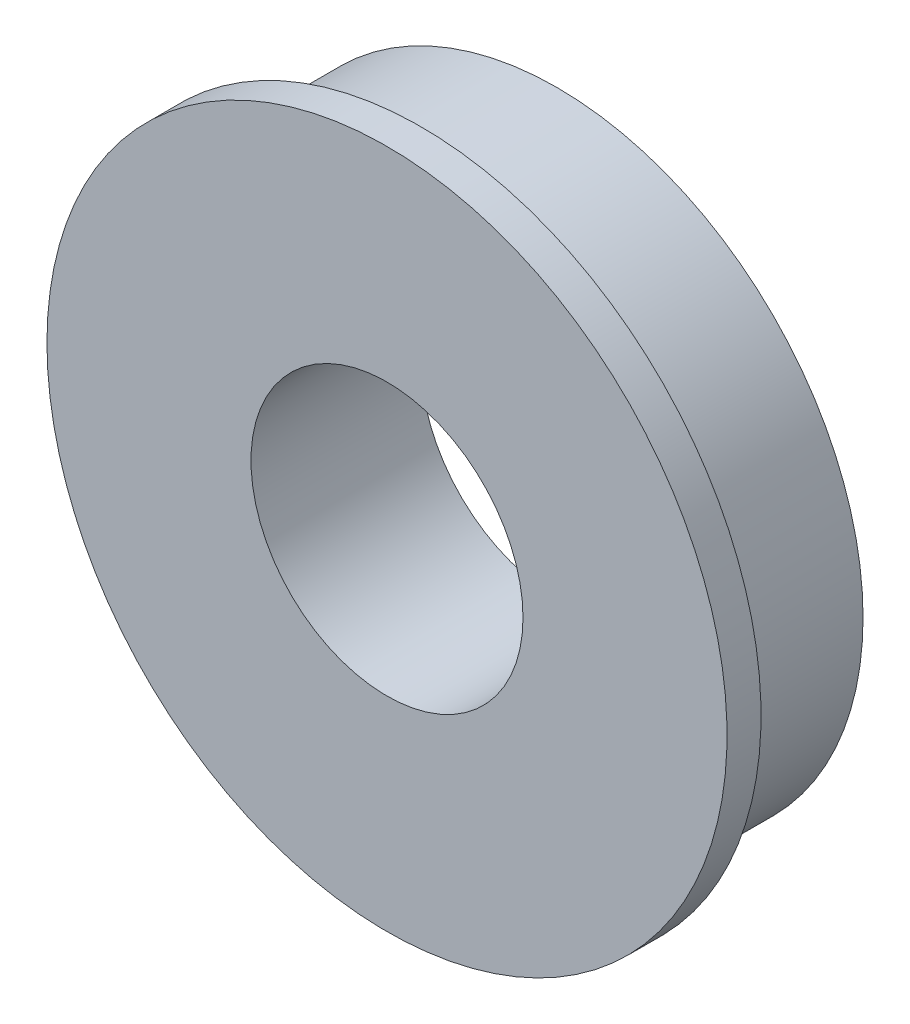
ISO-10303-21;
HEADER;
FILE_DESCRIPTION(('STEP AP214'),'2;1');
FILE_NAME('part.step','',(''),(''),'','','');
FILE_SCHEMA(('AUTOMOTIVE_DESIGN { 1 0 10303 214 1 1 1 1 }'));
ENDSEC;
DATA;
#1=APPLICATION_CONTEXT('core data for automotive mechanical design processes');
#2=APPLICATION_PROTOCOL_DEFINITION('international standard','automotive_design',2000,#1);
#3=PRODUCT_CONTEXT('',#1,'mechanical');
#4=PRODUCT('Part','Part','',(#3));
#5=PRODUCT_RELATED_PRODUCT_CATEGORY('part','',(#4));
#6=PRODUCT_DEFINITION_FORMATION('','',#4);
#7=PRODUCT_DEFINITION_CONTEXT('part definition',#1,'design');
#8=PRODUCT_DEFINITION('design','',#6,#7);
#9=PRODUCT_DEFINITION_SHAPE('','',#8);
#10=(LENGTH_UNIT() NAMED_UNIT(*) SI_UNIT(.MILLI.,.METRE.));
#11=(NAMED_UNIT(*) PLANE_ANGLE_UNIT() SI_UNIT($,.RADIAN.));
#12=(NAMED_UNIT(*) SI_UNIT($,.STERADIAN.) SOLID_ANGLE_UNIT());
#13=UNCERTAINTY_MEASURE_WITH_UNIT(LENGTH_MEASURE(1.E-05),#10,'distance_accuracy_value','');
#14=(GEOMETRIC_REPRESENTATION_CONTEXT(3) GLOBAL_UNCERTAINTY_ASSIGNED_CONTEXT((#13)) GLOBAL_UNIT_ASSIGNED_CONTEXT((#10,
#11,#12)) REPRESENTATION_CONTEXT('',''));
#15=CARTESIAN_POINT('',(0.,0.,0.));
#16=DIRECTION('',(0.,0.,1.));
#17=DIRECTION('',(1.,0.,0.));
#18=AXIS2_PLACEMENT_3D('',#15,#16,#17);
#19=CARTESIAN_POINT('',(0.,0.,0.));
#20=DIRECTION('',(0.,0.,-1.));
#21=DIRECTION('',(-1.,0.,0.));
#22=AXIS2_PLACEMENT_3D('',#19,#20,#21);
#23=PLANE('',#22);
#24=CARTESIAN_POINT('',(0.,0.,0.));
#25=DIRECTION('',(0.,0.,1.));
#26=DIRECTION('',(1.,0.,0.));
#27=AXIS2_PLACEMENT_3D('',#24,#25,#26);
#28=CIRCLE('',#27,6.35);
#29=CARTESIAN_POINT('',(6.35,0.,0.));
#30=VERTEX_POINT('',#29);
#31=EDGE_CURVE('E33',#30,#30,#28,.F.);
#32=ORIENTED_EDGE('',*,*,#31,.F.);
#33=EDGE_LOOP('',(#32));
#34=FACE_BOUND('',#33,.T.);
#35=CARTESIAN_POINT('',(0.,0.,0.));
#36=DIRECTION('',(0.,0.,1.));
#37=DIRECTION('',(1.,0.,0.));
#38=AXIS2_PLACEMENT_3D('',#35,#36,#37);
#39=CIRCLE('',#38,14.2875);
#40=CARTESIAN_POINT('',(14.2875,0.,0.));
#41=VERTEX_POINT('',#40);
#42=EDGE_CURVE('E17',#41,#41,#39,.T.);
#43=ORIENTED_EDGE('',*,*,#42,.F.);
#44=EDGE_LOOP('',(#43));
#45=FACE_BOUND('',#44,.T.);
#46=ADVANCED_FACE('F14',(#34,#45),#23,.T.);
#47=CARTESIAN_POINT('',(0.,0.,0.));
#48=DIRECTION('',(0.,0.,1.));
#49=DIRECTION('',(1.,0.,0.));
#50=AXIS2_PLACEMENT_3D('',#47,#48,#49);
#51=CYLINDRICAL_SURFACE('',#50,14.2875);
#52=ORIENTED_EDGE('',*,*,#42,.T.);
#53=EDGE_LOOP('',(#52));
#54=FACE_BOUND('',#53,.T.);
#55=CARTESIAN_POINT('',(0.,0.,6.35));
#56=DIRECTION('',(0.,0.,1.));
#57=DIRECTION('',(1.,0.,0.));
#58=AXIS2_PLACEMENT_3D('',#55,#56,#57);
#59=CIRCLE('',#58,14.2875);
#60=CARTESIAN_POINT('',(14.2875,0.,6.35));
#61=VERTEX_POINT('',#60);
#62=EDGE_CURVE('E31',#61,#61,#59,.T.);
#63=ORIENTED_EDGE('',*,*,#62,.F.);
#64=EDGE_LOOP('',(#63));
#65=FACE_BOUND('',#64,.T.);
#66=ADVANCED_FACE('F40',(#54,#65),#51,.T.);
#67=CARTESIAN_POINT('',(0.,0.,0.));
#68=DIRECTION('',(0.,0.,1.));
#69=DIRECTION('',(1.,0.,0.));
#70=AXIS2_PLACEMENT_3D('',#67,#68,#69);
#71=CYLINDRICAL_SURFACE('',#70,6.35);
#72=ORIENTED_EDGE('',*,*,#31,.T.);
#73=EDGE_LOOP('',(#72));
#74=FACE_BOUND('',#73,.T.);
#75=CARTESIAN_POINT('',(0.,0.,7.9375));
#76=DIRECTION('',(0.,0.,1.));
#77=DIRECTION('',(1.,0.,0.));
#78=AXIS2_PLACEMENT_3D('',#75,#76,#77);
#79=CIRCLE('',#78,6.35);
#80=CARTESIAN_POINT('',(6.35,0.,7.9375));
#81=VERTEX_POINT('',#80);
#82=EDGE_CURVE('E26',#81,#81,#79,.F.);
#83=ORIENTED_EDGE('',*,*,#82,.F.);
#84=EDGE_LOOP('',(#83));
#85=FACE_BOUND('',#84,.T.);
#86=ADVANCED_FACE('F49',(#74,#85),#71,.F.);
#87=CARTESIAN_POINT('',(0.,0.,6.35));
#88=DIRECTION('',(0.,0.,-1.));
#89=DIRECTION('',(-1.,0.,0.));
#90=AXIS2_PLACEMENT_3D('',#87,#88,#89);
#91=PLANE('',#90);
#92=ORIENTED_EDGE('',*,*,#62,.T.);
#93=EDGE_LOOP('',(#92));
#94=FACE_BOUND('',#93,.T.);
#95=CARTESIAN_POINT('',(0.,0.,6.35));
#96=DIRECTION('',(0.,0.,-1.));
#97=DIRECTION('',(-1.,0.,0.));
#98=AXIS2_PLACEMENT_3D('',#95,#96,#97);
#99=CIRCLE('',#98,15.875);
#100=CARTESIAN_POINT('',(-15.875,0.,6.35));
#101=VERTEX_POINT('',#100);
#102=EDGE_CURVE('E21',#101,#101,#99,.F.);
#103=ORIENTED_EDGE('',*,*,#102,.F.);
#104=EDGE_LOOP('',(#103));
#105=FACE_BOUND('',#104,.T.);
#106=ADVANCED_FACE('F57',(#94,#105),#91,.T.);
#107=CARTESIAN_POINT('',(0.,0.,7.9375));
#108=DIRECTION('',(0.,0.,1.));
#109=DIRECTION('',(1.,0.,0.));
#110=AXIS2_PLACEMENT_3D('',#107,#108,#109);
#111=PLANE('',#110);
#112=ORIENTED_EDGE('',*,*,#82,.T.);
#113=EDGE_LOOP('',(#112));
#114=FACE_BOUND('',#113,.T.);
#115=CARTESIAN_POINT('',(0.,0.,7.9375));
#116=DIRECTION('',(0.,0.,-1.));
#117=DIRECTION('',(-1.,0.,0.));
#118=AXIS2_PLACEMENT_3D('',#115,#116,#117);
#119=CIRCLE('',#118,15.875);
#120=CARTESIAN_POINT('',(-15.875,0.,7.9375));
#121=VERTEX_POINT('',#120);
#122=EDGE_CURVE('E10',#121,#121,#119,.T.);
#123=ORIENTED_EDGE('',*,*,#122,.F.);
#124=EDGE_LOOP('',(#123));
#125=FACE_BOUND('',#124,.T.);
#126=ADVANCED_FACE('F52',(#114,#125),#111,.T.);
#127=CARTESIAN_POINT('',(0.,0.,7.9375));
#128=DIRECTION('',(0.,0.,-1.));
#129=DIRECTION('',(-1.,0.,0.));
#130=AXIS2_PLACEMENT_3D('',#127,#128,#129);
#131=CYLINDRICAL_SURFACE('',#130,15.875);
#132=ORIENTED_EDGE('',*,*,#122,.T.);
#133=EDGE_LOOP('',(#132));
#134=FACE_BOUND('',#133,.T.);
#135=ORIENTED_EDGE('',*,*,#102,.T.);
#136=EDGE_LOOP('',(#135));
#137=FACE_BOUND('',#136,.T.);
#138=ADVANCED_FACE('F50',(#134,#137),#131,.T.);
#139=CLOSED_SHELL('',(#46,#66,#86,#106,#126,#138));
#140=MANIFOLD_SOLID_BREP('B1',#139);
#141=ADVANCED_BREP_SHAPE_REPRESENTATION('',(#18,#140),#14);
#142=SHAPE_DEFINITION_REPRESENTATION(#9,#141);
ENDSEC;
END-ISO-10303-21;
